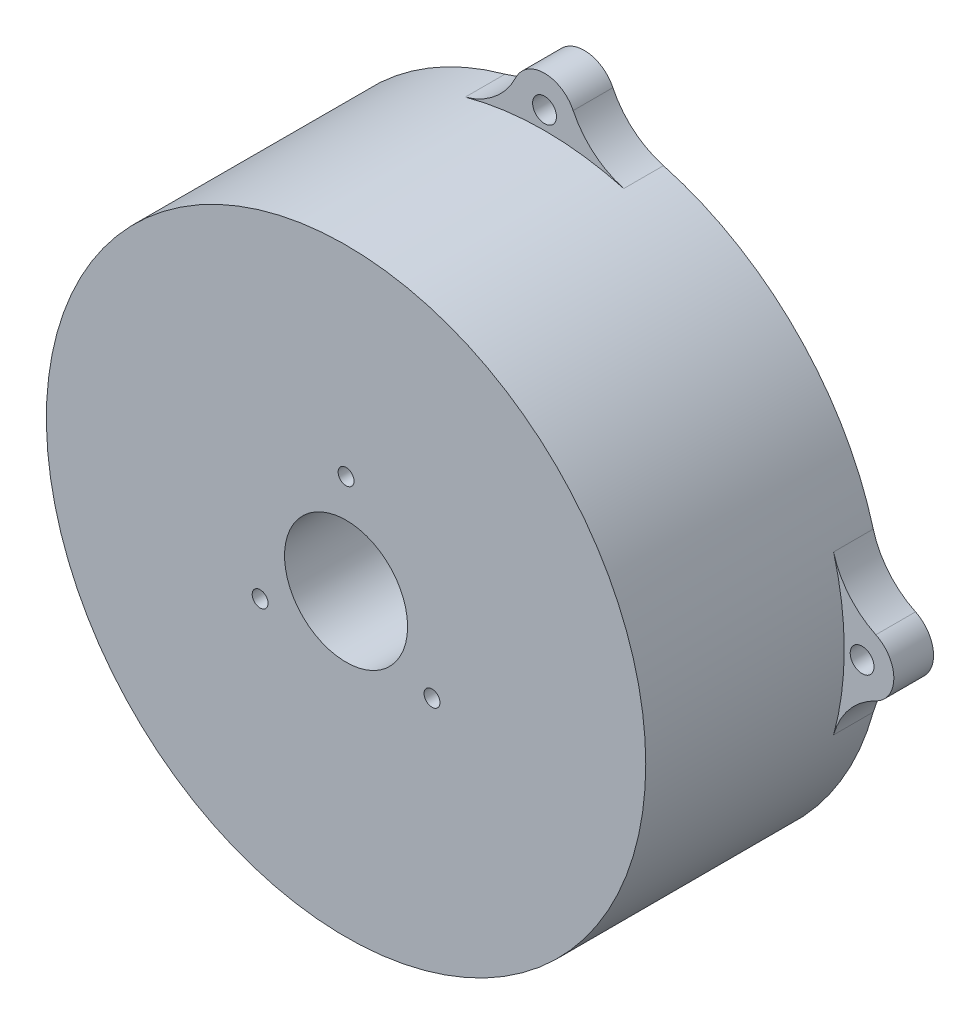
ISO-10303-21;
HEADER;
FILE_DESCRIPTION(('STEP AP214'),'2;1');
FILE_NAME('part.step','',(''),(''),'','','');
FILE_SCHEMA(('AUTOMOTIVE_DESIGN { 1 0 10303 214 1 1 1 1 }'));
ENDSEC;
DATA;
#1=APPLICATION_CONTEXT('core data for automotive mechanical design processes');
#2=APPLICATION_PROTOCOL_DEFINITION('international standard','automotive_design',2000,#1);
#3=PRODUCT_CONTEXT('',#1,'mechanical');
#4=PRODUCT('Part','Part','',(#3));
#5=PRODUCT_RELATED_PRODUCT_CATEGORY('part','',(#4));
#6=PRODUCT_DEFINITION_FORMATION('','',#4);
#7=PRODUCT_DEFINITION_CONTEXT('part definition',#1,'design');
#8=PRODUCT_DEFINITION('design','',#6,#7);
#9=PRODUCT_DEFINITION_SHAPE('','',#8);
#10=(LENGTH_UNIT() NAMED_UNIT(*) SI_UNIT(.MILLI.,.METRE.));
#11=(NAMED_UNIT(*) PLANE_ANGLE_UNIT() SI_UNIT($,.RADIAN.));
#12=(NAMED_UNIT(*) SI_UNIT($,.STERADIAN.) SOLID_ANGLE_UNIT());
#13=UNCERTAINTY_MEASURE_WITH_UNIT(LENGTH_MEASURE(1.E-05),#10,'distance_accuracy_value','');
#14=(GEOMETRIC_REPRESENTATION_CONTEXT(3) GLOBAL_UNCERTAINTY_ASSIGNED_CONTEXT((#13)) GLOBAL_UNIT_ASSIGNED_CONTEXT((#10,
#11,#12)) REPRESENTATION_CONTEXT('',''));
#15=CARTESIAN_POINT('',(0.,0.,0.));
#16=DIRECTION('',(0.,0.,1.));
#17=DIRECTION('',(1.,0.,0.));
#18=AXIS2_PLACEMENT_3D('',#15,#16,#17);
#19=CARTESIAN_POINT('',(0.,0.,30.));
#20=DIRECTION('',(0.,0.,1.));
#21=DIRECTION('',(1.,0.,0.));
#22=AXIS2_PLACEMENT_3D('',#19,#20,#21);
#23=PLANE('',#22);
#24=CARTESIAN_POINT('',(0.,12.5,30.));
#25=DIRECTION('',(0.,0.,1.));
#26=DIRECTION('',(1.,0.,0.));
#27=AXIS2_PLACEMENT_3D('',#24,#25,#26);
#28=CIRCLE('',#27,1.);
#29=CARTESIAN_POINT('',(1.,12.5,30.));
#30=VERTEX_POINT('',#29);
#31=EDGE_CURVE('E216',#30,#30,#28,.T.);
#32=ORIENTED_EDGE('',*,*,#31,.F.);
#33=EDGE_LOOP('',(#32));
#34=FACE_BOUND('',#33,.T.);
#35=CARTESIAN_POINT('',(10.825317547306,-6.24999999999969,30.));
#36=DIRECTION('',(0.,0.,1.));
#37=DIRECTION('',(1.,0.,0.));
#38=AXIS2_PLACEMENT_3D('',#35,#36,#37);
#39=CIRCLE('',#38,1.00000000000048);
#40=CARTESIAN_POINT('',(11.8253175473065,-6.24999999999969,30.));
#41=VERTEX_POINT('',#40);
#42=EDGE_CURVE('E213',#41,#41,#39,.T.);
#43=ORIENTED_EDGE('',*,*,#42,.F.);
#44=EDGE_LOOP('',(#43));
#45=FACE_BOUND('',#44,.T.);
#46=CARTESIAN_POINT('',(-10.825317547305,-6.25000000000031,30.));
#47=DIRECTION('',(0.,0.,1.));
#48=DIRECTION('',(1.,0.,0.));
#49=AXIS2_PLACEMENT_3D('',#46,#47,#48);
#50=CIRCLE('',#49,1.00000000000071);
#51=CARTESIAN_POINT('',(-9.82531754730424,-6.25000000000031,30.));
#52=VERTEX_POINT('',#51);
#53=EDGE_CURVE('E206',#52,#52,#50,.T.);
#54=ORIENTED_EDGE('',*,*,#53,.F.);
#55=EDGE_LOOP('',(#54));
#56=FACE_BOUND('',#55,.T.);
#57=CARTESIAN_POINT('',(0.,0.,30.));
#58=DIRECTION('',(0.,0.,1.));
#59=DIRECTION('',(1.,0.,0.));
#60=AXIS2_PLACEMENT_3D('',#57,#58,#59);
#61=CIRCLE('',#60,37.75);
#62=CARTESIAN_POINT('',(37.75,0.,30.));
#63=VERTEX_POINT('',#62);
#64=EDGE_CURVE('E182',#63,#63,#61,.T.);
#65=ORIENTED_EDGE('',*,*,#64,.T.);
#66=EDGE_LOOP('',(#65));
#67=FACE_BOUND('',#66,.T.);
#68=CARTESIAN_POINT('',(0.,0.,30.));
#69=DIRECTION('',(0.,0.,1.));
#70=DIRECTION('',(1.,0.,0.));
#71=AXIS2_PLACEMENT_3D('',#68,#69,#70);
#72=CIRCLE('',#71,7.75);
#73=CARTESIAN_POINT('',(7.75,0.,30.));
#74=VERTEX_POINT('',#73);
#75=EDGE_CURVE('E191',#74,#74,#72,.T.);
#76=ORIENTED_EDGE('',*,*,#75,.F.);
#77=EDGE_LOOP('',(#76));
#78=FACE_BOUND('',#77,.T.);
#79=ADVANCED_FACE('F37',(#34,#45,#56,#67,#78),#23,.T.);
#80=CARTESIAN_POINT('',(0.,0.,0.));
#81=DIRECTION('',(0.,0.,1.));
#82=DIRECTION('',(1.,0.,0.));
#83=AXIS2_PLACEMENT_3D('',#80,#81,#82);
#84=PLANE('',#83);
#85=CARTESIAN_POINT('',(0.,0.,0.));
#86=DIRECTION('',(0.,0.,1.));
#87=DIRECTION('',(1.,0.,0.));
#88=AXIS2_PLACEMENT_3D('',#85,#86,#87);
#89=CIRCLE('',#88,37.75);
#90=CARTESIAN_POINT('',(36.4066385798428,9.98094020204009,0.));
#91=VERTEX_POINT('',#90);
#92=CARTESIAN_POINT('',(9.9809402020397,36.4066385798429,0.));
#93=VERTEX_POINT('',#92);
#94=EDGE_CURVE('E185',#91,#93,#89,.T.);
#95=ORIENTED_EDGE('',*,*,#94,.F.);
#96=CARTESIAN_POINT('',(46.0507812499999,12.6248978714547,0.));
#97=DIRECTION('',(0.,0.,1.));
#98=DIRECTION('',(1.,0.,0.));
#99=AXIS2_PLACEMENT_3D('',#96,#97,#98);
#100=CIRCLE('',#99,10.);
#101=CARTESIAN_POINT('',(41.7287946428571,3.60711367755878,0.));
#102=VERTEX_POINT('',#101);
#103=EDGE_CURVE('E45',#91,#102,#100,.T.);
#104=ORIENTED_EDGE('',*,*,#103,.T.);
#105=CARTESIAN_POINT('',(40.,4.19845122399165E-13,0.));
#106=DIRECTION('',(0.,0.,-1.));
#107=DIRECTION('',(0.,-1.,0.));
#108=AXIS2_PLACEMENT_3D('',#105,#106,#107);
#109=CIRCLE('',#108,4.);
#110=CARTESIAN_POINT('',(41.7287946428572,-3.6071136775579,0.));
#111=VERTEX_POINT('',#110);
#112=EDGE_CURVE('E255',#102,#111,#109,.T.);
#113=ORIENTED_EDGE('',*,*,#112,.T.);
#114=CARTESIAN_POINT('',(46.0507812500001,-12.6248978714537,0.));
#115=DIRECTION('',(0.,0.,1.));
#116=DIRECTION('',(1.,0.,0.));
#117=AXIS2_PLACEMENT_3D('',#114,#115,#116);
#118=CIRCLE('',#117,10.);
#119=CARTESIAN_POINT('',(36.406638579843,-9.98094020203932,0.));
#120=VERTEX_POINT('',#119);
#121=EDGE_CURVE('E320',#111,#120,#118,.T.);
#122=ORIENTED_EDGE('',*,*,#121,.T.);
#123=CARTESIAN_POINT('',(9.98094020203971,-36.4066385798429,0.));
#124=VERTEX_POINT('',#123);
#125=EDGE_CURVE('E189',#124,#120,#89,.T.);
#126=ORIENTED_EDGE('',*,*,#125,.F.);
#127=CARTESIAN_POINT('',(12.6248978714542,-46.05078125,0.));
#128=DIRECTION('',(0.,0.,1.));
#129=DIRECTION('',(1.,0.,0.));
#130=AXIS2_PLACEMENT_3D('',#127,#128,#129);
#131=CIRCLE('',#130,10.);
#132=CARTESIAN_POINT('',(3.60711367755834,-41.7287946428571,0.));
#133=VERTEX_POINT('',#132);
#134=EDGE_CURVE('E336',#124,#133,#131,.T.);
#135=ORIENTED_EDGE('',*,*,#134,.T.);
#136=CARTESIAN_POINT('',(0.,-40.,0.));
#137=DIRECTION('',(0.,0.,-1.));
#138=DIRECTION('',(-1.,0.,0.));
#139=AXIS2_PLACEMENT_3D('',#136,#137,#138);
#140=CIRCLE('',#139,4.);
#141=CARTESIAN_POINT('',(-3.60711367755834,-41.7287946428571,0.));
#142=VERTEX_POINT('',#141);
#143=EDGE_CURVE('E243',#133,#142,#140,.T.);
#144=ORIENTED_EDGE('',*,*,#143,.T.);
#145=CARTESIAN_POINT('',(-12.6248978714542,-46.05078125,0.));
#146=DIRECTION('',(0.,0.,1.));
#147=DIRECTION('',(1.,0.,0.));
#148=AXIS2_PLACEMENT_3D('',#145,#146,#147);
#149=CIRCLE('',#148,10.);
#150=CARTESIAN_POINT('',(-9.9809402020397,-36.4066385798429,0.));
#151=VERTEX_POINT('',#150);
#152=EDGE_CURVE('E338',#142,#151,#149,.T.);
#153=ORIENTED_EDGE('',*,*,#152,.T.);
#154=CARTESIAN_POINT('',(-36.4066385798429,-9.98094020203983,0.));
#155=VERTEX_POINT('',#154);
#156=EDGE_CURVE('E183',#155,#151,#89,.T.);
#157=ORIENTED_EDGE('',*,*,#156,.F.);
#158=CARTESIAN_POINT('',(-46.05078125,-12.6248978714544,0.));
#159=DIRECTION('',(0.,0.,1.));
#160=DIRECTION('',(1.,0.,0.));
#161=AXIS2_PLACEMENT_3D('',#158,#159,#160);
#162=CIRCLE('',#161,10.);
#163=CARTESIAN_POINT('',(-41.7287946428571,-3.60711367755849,0.));
#164=VERTEX_POINT('',#163);
#165=EDGE_CURVE('E355',#155,#164,#162,.T.);
#166=ORIENTED_EDGE('',*,*,#165,.T.);
#167=CARTESIAN_POINT('',(-40.,-1.40526615291714E-13,0.));
#168=DIRECTION('',(0.,0.,-1.));
#169=DIRECTION('',(0.,1.,0.));
#170=AXIS2_PLACEMENT_3D('',#167,#168,#169);
#171=CIRCLE('',#170,4.);
#172=CARTESIAN_POINT('',(-41.7287946428572,3.6071136775582,0.));
#173=VERTEX_POINT('',#172);
#174=EDGE_CURVE('E232',#164,#173,#171,.T.);
#175=ORIENTED_EDGE('',*,*,#174,.T.);
#176=CARTESIAN_POINT('',(-46.05078125,12.624897871454,0.));
#177=DIRECTION('',(0.,0.,1.));
#178=DIRECTION('',(1.,0.,0.));
#179=AXIS2_PLACEMENT_3D('',#176,#177,#178);
#180=CIRCLE('',#179,10.);
#181=CARTESIAN_POINT('',(-36.406638579843,9.98094020203958,0.));
#182=VERTEX_POINT('',#181);
#183=EDGE_CURVE('E181',#173,#182,#180,.T.);
#184=ORIENTED_EDGE('',*,*,#183,.T.);
#185=CARTESIAN_POINT('',(-9.98094020203971,36.4066385798429,0.));
#186=VERTEX_POINT('',#185);
#187=EDGE_CURVE('E169',#186,#182,#89,.T.);
#188=ORIENTED_EDGE('',*,*,#187,.F.);
#189=CARTESIAN_POINT('',(-12.6248978714542,46.05078125,0.));
#190=DIRECTION('',(0.,0.,1.));
#191=DIRECTION('',(1.,0.,0.));
#192=AXIS2_PLACEMENT_3D('',#189,#190,#191);
#193=CIRCLE('',#192,10.);
#194=CARTESIAN_POINT('',(-3.60711367755834,41.7287946428571,0.));
#195=VERTEX_POINT('',#194);
#196=EDGE_CURVE('E151',#186,#195,#193,.T.);
#197=ORIENTED_EDGE('',*,*,#196,.T.);
#198=CARTESIAN_POINT('',(0.,40.,0.));
#199=DIRECTION('',(0.,0.,-1.));
#200=DIRECTION('',(1.,0.,0.));
#201=AXIS2_PLACEMENT_3D('',#198,#199,#200);
#202=CIRCLE('',#201,4.);
#203=CARTESIAN_POINT('',(3.60711367755834,41.7287946428571,0.));
#204=VERTEX_POINT('',#203);
#205=EDGE_CURVE('E221',#195,#204,#202,.T.);
#206=ORIENTED_EDGE('',*,*,#205,.T.);
#207=CARTESIAN_POINT('',(12.6248978714542,46.05078125,0.));
#208=DIRECTION('',(0.,0.,1.));
#209=DIRECTION('',(1.,0.,0.));
#210=AXIS2_PLACEMENT_3D('',#207,#208,#209);
#211=CIRCLE('',#210,10.);
#212=EDGE_CURVE('E162',#204,#93,#211,.T.);
#213=ORIENTED_EDGE('',*,*,#212,.T.);
#214=EDGE_LOOP('',(#95,#104,#113,#122,#126,#135,#144,#153,#157,#166,#175,#184,#188,#197,#206,#213));
#215=FACE_BOUND('',#214,.T.);
#216=CARTESIAN_POINT('',(0.,0.,0.));
#217=DIRECTION('',(0.,0.,1.));
#218=DIRECTION('',(1.,0.,0.));
#219=AXIS2_PLACEMENT_3D('',#216,#217,#218);
#220=CIRCLE('',#219,7.75);
#221=CARTESIAN_POINT('',(7.75,0.,0.));
#222=VERTEX_POINT('',#221);
#223=EDGE_CURVE('E195',#222,#222,#220,.T.);
#224=ORIENTED_EDGE('',*,*,#223,.T.);
#225=EDGE_LOOP('',(#224));
#226=FACE_BOUND('',#225,.T.);
#227=CARTESIAN_POINT('',(0.,40.,0.));
#228=DIRECTION('',(0.,0.,-1.));
#229=DIRECTION('',(-1.,0.,0.));
#230=AXIS2_PLACEMENT_3D('',#227,#228,#229);
#231=CIRCLE('',#230,1.5);
#232=CARTESIAN_POINT('',(-1.5,40.,0.));
#233=VERTEX_POINT('',#232);
#234=EDGE_CURVE('E226',#233,#233,#231,.T.);
#235=ORIENTED_EDGE('',*,*,#234,.F.);
#236=EDGE_LOOP('',(#235));
#237=FACE_BOUND('',#236,.T.);
#238=CARTESIAN_POINT('',(-40.,-1.39659253553725E-13,0.));
#239=DIRECTION('',(0.,0.,-1.));
#240=DIRECTION('',(0.,-1.,0.));
#241=AXIS2_PLACEMENT_3D('',#238,#239,#240);
#242=CIRCLE('',#241,1.5);
#243=CARTESIAN_POINT('',(-40.,-1.50000000000014,0.));
#244=VERTEX_POINT('',#243);
#245=EDGE_CURVE('E237',#244,#244,#242,.T.);
#246=ORIENTED_EDGE('',*,*,#245,.F.);
#247=EDGE_LOOP('',(#246));
#248=FACE_BOUND('',#247,.T.);
#249=CARTESIAN_POINT('',(0.,-40.,0.));
#250=DIRECTION('',(0.,0.,-1.));
#251=DIRECTION('',(1.,0.,0.));
#252=AXIS2_PLACEMENT_3D('',#249,#250,#251);
#253=CIRCLE('',#252,1.5);
#254=CARTESIAN_POINT('',(1.5,-40.,0.));
#255=VERTEX_POINT('',#254);
#256=EDGE_CURVE('E249',#255,#255,#253,.T.);
#257=ORIENTED_EDGE('',*,*,#256,.F.);
#258=EDGE_LOOP('',(#257));
#259=FACE_BOUND('',#258,.T.);
#260=CARTESIAN_POINT('',(40.,4.18977760661176E-13,0.));
#261=DIRECTION('',(0.,0.,-1.));
#262=DIRECTION('',(0.,1.,0.));
#263=AXIS2_PLACEMENT_3D('',#260,#261,#262);
#264=CIRCLE('',#263,1.5);
#265=CARTESIAN_POINT('',(40.,1.50000000000042,0.));
#266=VERTEX_POINT('',#265);
#267=EDGE_CURVE('E260',#266,#266,#264,.T.);
#268=ORIENTED_EDGE('',*,*,#267,.F.);
#269=EDGE_LOOP('',(#268));
#270=FACE_BOUND('',#269,.T.);
#271=ADVANCED_FACE('F177',(#215,#226,#237,#248,#259,#270),#84,.F.);
#272=CARTESIAN_POINT('',(0.,0.,30.));
#273=DIRECTION('',(0.,0.,-1.));
#274=DIRECTION('',(-1.,0.,0.));
#275=AXIS2_PLACEMENT_3D('',#272,#273,#274);
#276=CYLINDRICAL_SURFACE('',#275,37.75);
#277=ORIENTED_EDGE('',*,*,#64,.F.);
#278=EDGE_LOOP('',(#277));
#279=FACE_BOUND('',#278,.T.);
#280=ORIENTED_EDGE('',*,*,#125,.T.);
#281=DIRECTION('',(0.,0.,-1.));
#282=VECTOR('',#281,1.);
#283=CARTESIAN_POINT('',(36.406638579843,-9.98094020203932,30.));
#284=LINE('',#283,#282);
#285=CARTESIAN_POINT('',(36.406638579843,-9.98094020203932,5.));
#286=VERTEX_POINT('',#285);
#287=EDGE_CURVE('E323',#120,#286,#284,.F.);
#288=ORIENTED_EDGE('',*,*,#287,.T.);
#289=CARTESIAN_POINT('',(0.,0.,5.));
#290=DIRECTION('',(0.,0.,1.));
#291=DIRECTION('',(1.,0.,0.));
#292=AXIS2_PLACEMENT_3D('',#289,#290,#291);
#293=CIRCLE('',#292,37.75);
#294=CARTESIAN_POINT('',(36.4066385798428,9.98094020204009,5.));
#295=VERTEX_POINT('',#294);
#296=EDGE_CURVE('E369',#286,#295,#293,.T.);
#297=ORIENTED_EDGE('',*,*,#296,.T.);
#298=DIRECTION('',(0.,0.,-1.));
#299=VECTOR('',#298,1.);
#300=CARTESIAN_POINT('',(36.4066385798428,9.98094020204009,30.));
#301=LINE('',#300,#299);
#302=EDGE_CURVE('E331',#295,#91,#301,.T.);
#303=ORIENTED_EDGE('',*,*,#302,.T.);
#304=ORIENTED_EDGE('',*,*,#94,.T.);
#305=DIRECTION('',(0.,0.,-1.));
#306=VECTOR('',#305,1.);
#307=CARTESIAN_POINT('',(9.9809402020397,36.4066385798429,30.));
#308=LINE('',#307,#306);
#309=CARTESIAN_POINT('',(9.9809402020397,36.4066385798429,5.));
#310=VERTEX_POINT('',#309);
#311=EDGE_CURVE('E174',#93,#310,#308,.F.);
#312=ORIENTED_EDGE('',*,*,#311,.T.);
#313=CARTESIAN_POINT('',(0.,0.,5.));
#314=DIRECTION('',(0.,0.,1.));
#315=DIRECTION('',(1.,0.,0.));
#316=AXIS2_PLACEMENT_3D('',#313,#314,#315);
#317=CIRCLE('',#316,37.75);
#318=CARTESIAN_POINT('',(-9.98094020203971,36.4066385798429,5.));
#319=VERTEX_POINT('',#318);
#320=EDGE_CURVE('E172',#310,#319,#317,.T.);
#321=ORIENTED_EDGE('',*,*,#320,.T.);
#322=DIRECTION('',(0.,0.,-1.));
#323=VECTOR('',#322,1.);
#324=CARTESIAN_POINT('',(-9.98094020203971,36.4066385798429,30.));
#325=LINE('',#324,#323);
#326=EDGE_CURVE('E155',#319,#186,#325,.T.);
#327=ORIENTED_EDGE('',*,*,#326,.T.);
#328=ORIENTED_EDGE('',*,*,#187,.T.);
#329=DIRECTION('',(0.,0.,-1.));
#330=VECTOR('',#329,1.);
#331=CARTESIAN_POINT('',(-36.406638579843,9.98094020203958,30.));
#332=LINE('',#331,#330);
#333=CARTESIAN_POINT('',(-36.406638579843,9.98094020203958,5.));
#334=VERTEX_POINT('',#333);
#335=EDGE_CURVE('E364',#182,#334,#332,.F.);
#336=ORIENTED_EDGE('',*,*,#335,.T.);
#337=CARTESIAN_POINT('',(0.,0.,5.));
#338=DIRECTION('',(0.,0.,1.));
#339=DIRECTION('',(1.,0.,0.));
#340=AXIS2_PLACEMENT_3D('',#337,#338,#339);
#341=CIRCLE('',#340,37.75);
#342=CARTESIAN_POINT('',(-36.4066385798429,-9.98094020203983,5.));
#343=VERTEX_POINT('',#342);
#344=EDGE_CURVE('E373',#334,#343,#341,.T.);
#345=ORIENTED_EDGE('',*,*,#344,.T.);
#346=DIRECTION('',(0.,0.,-1.));
#347=VECTOR('',#346,1.);
#348=CARTESIAN_POINT('',(-36.4066385798429,-9.98094020203983,30.));
#349=LINE('',#348,#347);
#350=EDGE_CURVE('E366',#343,#155,#349,.T.);
#351=ORIENTED_EDGE('',*,*,#350,.T.);
#352=ORIENTED_EDGE('',*,*,#156,.T.);
#353=DIRECTION('',(0.,0.,-1.));
#354=VECTOR('',#353,1.);
#355=CARTESIAN_POINT('',(-9.9809402020397,-36.4066385798429,30.));
#356=LINE('',#355,#354);
#357=CARTESIAN_POINT('',(-9.9809402020397,-36.4066385798429,5.));
#358=VERTEX_POINT('',#357);
#359=EDGE_CURVE('E346',#151,#358,#356,.F.);
#360=ORIENTED_EDGE('',*,*,#359,.T.);
#361=CARTESIAN_POINT('',(0.,0.,5.));
#362=DIRECTION('',(0.,0.,1.));
#363=DIRECTION('',(1.,0.,0.));
#364=AXIS2_PLACEMENT_3D('',#361,#362,#363);
#365=CIRCLE('',#364,37.75);
#366=CARTESIAN_POINT('',(9.98094020203971,-36.4066385798429,5.));
#367=VERTEX_POINT('',#366);
#368=EDGE_CURVE('E371',#358,#367,#365,.T.);
#369=ORIENTED_EDGE('',*,*,#368,.T.);
#370=DIRECTION('',(0.,0.,-1.));
#371=VECTOR('',#370,1.);
#372=CARTESIAN_POINT('',(9.98094020203971,-36.4066385798429,30.));
#373=LINE('',#372,#371);
#374=EDGE_CURVE('E349',#367,#124,#373,.T.);
#375=ORIENTED_EDGE('',*,*,#374,.T.);
#376=EDGE_LOOP('',(#280,#288,#297,#303,#304,#312,#321,#327,#328,#336,#345,#351,#352,#360,#369,#375));
#377=FACE_BOUND('',#376,.T.);
#378=ADVANCED_FACE('F167',(#279,#377),#276,.T.);
#379=CARTESIAN_POINT('',(0.,0.,30.));
#380=DIRECTION('',(0.,0.,-1.));
#381=DIRECTION('',(-1.,0.,0.));
#382=AXIS2_PLACEMENT_3D('',#379,#380,#381);
#383=CYLINDRICAL_SURFACE('',#382,7.75);
#384=ORIENTED_EDGE('',*,*,#75,.T.);
#385=EDGE_LOOP('',(#384));
#386=FACE_BOUND('',#385,.T.);
#387=ORIENTED_EDGE('',*,*,#223,.F.);
#388=EDGE_LOOP('',(#387));
#389=FACE_BOUND('',#388,.T.);
#390=ADVANCED_FACE('F281',(#386,#389),#383,.F.);
#391=CARTESIAN_POINT('',(-10.825317547305,-6.25000000000031,20.));
#392=DIRECTION('',(0.,0.,1.));
#393=DIRECTION('',(1.,0.,0.));
#394=AXIS2_PLACEMENT_3D('',#391,#392,#393);
#395=CYLINDRICAL_SURFACE('',#394,1.00000000000071);
#396=CARTESIAN_POINT('',(-10.825317547305,-6.25000000000031,20.));
#397=DIRECTION('',(0.,0.,1.));
#398=DIRECTION('',(1.,0.,0.));
#399=AXIS2_PLACEMENT_3D('',#396,#397,#398);
#400=CIRCLE('',#399,1.00000000000071);
#401=CARTESIAN_POINT('',(-9.82531754730424,-6.25000000000031,20.));
#402=VERTEX_POINT('',#401);
#403=EDGE_CURVE('E203',#402,#402,#400,.T.);
#404=ORIENTED_EDGE('',*,*,#403,.F.);
#405=EDGE_LOOP('',(#404));
#406=FACE_BOUND('',#405,.T.);
#407=ORIENTED_EDGE('',*,*,#53,.T.);
#408=EDGE_LOOP('',(#407));
#409=FACE_BOUND('',#408,.T.);
#410=ADVANCED_FACE('F475',(#406,#409),#395,.F.);
#411=CARTESIAN_POINT('',(-10.825317547305,-6.25000000000031,20.));
#412=DIRECTION('',(0.,0.,1.));
#413=DIRECTION('',(1.,0.,0.));
#414=AXIS2_PLACEMENT_3D('',#411,#412,#413);
#415=PLANE('',#414);
#416=ORIENTED_EDGE('',*,*,#403,.T.);
#417=EDGE_LOOP('',(#416));
#418=FACE_BOUND('',#417,.T.);
#419=ADVANCED_FACE('F470',(#418),#415,.T.);
#420=CARTESIAN_POINT('',(10.825317547306,-6.24999999999969,20.));
#421=DIRECTION('',(0.,0.,1.));
#422=DIRECTION('',(1.,0.,0.));
#423=AXIS2_PLACEMENT_3D('',#420,#421,#422);
#424=CYLINDRICAL_SURFACE('',#423,1.00000000000048);
#425=CARTESIAN_POINT('',(10.825317547306,-6.24999999999969,20.));
#426=DIRECTION('',(0.,0.,1.));
#427=DIRECTION('',(1.,0.,0.));
#428=AXIS2_PLACEMENT_3D('',#425,#426,#427);
#429=CIRCLE('',#428,1.00000000000048);
#430=CARTESIAN_POINT('',(11.8253175473065,-6.24999999999969,20.));
#431=VERTEX_POINT('',#430);
#432=EDGE_CURVE('E210',#431,#431,#429,.T.);
#433=ORIENTED_EDGE('',*,*,#432,.F.);
#434=EDGE_LOOP('',(#433));
#435=FACE_BOUND('',#434,.T.);
#436=ORIENTED_EDGE('',*,*,#42,.T.);
#437=EDGE_LOOP('',(#436));
#438=FACE_BOUND('',#437,.T.);
#439=ADVANCED_FACE('F467',(#435,#438),#424,.F.);
#440=CARTESIAN_POINT('',(10.825317547306,-6.24999999999969,20.));
#441=DIRECTION('',(0.,0.,1.));
#442=DIRECTION('',(1.,0.,0.));
#443=AXIS2_PLACEMENT_3D('',#440,#441,#442);
#444=PLANE('',#443);
#445=ORIENTED_EDGE('',*,*,#432,.T.);
#446=EDGE_LOOP('',(#445));
#447=FACE_BOUND('',#446,.T.);
#448=ADVANCED_FACE('F465',(#447),#444,.T.);
#449=CARTESIAN_POINT('',(0.,12.5,20.));
#450=DIRECTION('',(0.,0.,1.));
#451=DIRECTION('',(1.,0.,0.));
#452=AXIS2_PLACEMENT_3D('',#449,#450,#451);
#453=CYLINDRICAL_SURFACE('',#452,1.);
#454=CARTESIAN_POINT('',(0.,12.5,20.));
#455=DIRECTION('',(0.,0.,1.));
#456=DIRECTION('',(1.,0.,0.));
#457=AXIS2_PLACEMENT_3D('',#454,#455,#456);
#458=CIRCLE('',#457,1.);
#459=CARTESIAN_POINT('',(1.,12.5,20.));
#460=VERTEX_POINT('',#459);
#461=EDGE_CURVE('E200',#460,#460,#458,.T.);
#462=ORIENTED_EDGE('',*,*,#461,.F.);
#463=EDGE_LOOP('',(#462));
#464=FACE_BOUND('',#463,.T.);
#465=ORIENTED_EDGE('',*,*,#31,.T.);
#466=EDGE_LOOP('',(#465));
#467=FACE_BOUND('',#466,.T.);
#468=ADVANCED_FACE('F461',(#464,#467),#453,.F.);
#469=CARTESIAN_POINT('',(0.,12.5,20.));
#470=DIRECTION('',(0.,0.,1.));
#471=DIRECTION('',(1.,0.,0.));
#472=AXIS2_PLACEMENT_3D('',#469,#470,#471);
#473=PLANE('',#472);
#474=ORIENTED_EDGE('',*,*,#461,.T.);
#475=EDGE_LOOP('',(#474));
#476=FACE_BOUND('',#475,.T.);
#477=ADVANCED_FACE('F458',(#476),#473,.T.);
#478=CARTESIAN_POINT('',(0.,40.,5.));
#479=DIRECTION('',(0.,0.,-1.));
#480=DIRECTION('',(-1.,0.,0.));
#481=AXIS2_PLACEMENT_3D('',#478,#479,#480);
#482=CYLINDRICAL_SURFACE('',#481,4.);
#483=CARTESIAN_POINT('',(0.,40.,5.));
#484=DIRECTION('',(0.,0.,-1.));
#485=DIRECTION('',(1.,0.,0.));
#486=AXIS2_PLACEMENT_3D('',#483,#484,#485);
#487=CIRCLE('',#486,4.);
#488=CARTESIAN_POINT('',(-3.60711367755834,41.7287946428571,5.));
#489=VERTEX_POINT('',#488);
#490=CARTESIAN_POINT('',(3.60711367755834,41.7287946428571,5.));
#491=VERTEX_POINT('',#490);
#492=EDGE_CURVE('E207',#489,#491,#487,.T.);
#493=ORIENTED_EDGE('',*,*,#492,.T.);
#494=DIRECTION('',(0.,0.,-1.));
#495=VECTOR('',#494,1.);
#496=CARTESIAN_POINT('',(3.60711367755834,41.7287946428571,5.));
#497=LINE('',#496,#495);
#498=EDGE_CURVE('E379',#491,#204,#497,.T.);
#499=ORIENTED_EDGE('',*,*,#498,.T.);
#500=ORIENTED_EDGE('',*,*,#205,.F.);
#501=DIRECTION('',(0.,0.,-1.));
#502=VECTOR('',#501,1.);
#503=CARTESIAN_POINT('',(-3.60711367755834,41.7287946428571,5.));
#504=LINE('',#503,#502);
#505=EDGE_CURVE('E156',#195,#489,#504,.F.);
#506=ORIENTED_EDGE('',*,*,#505,.T.);
#507=EDGE_LOOP('',(#493,#499,#500,#506));
#508=FACE_BOUND('',#507,.T.);
#509=ADVANCED_FACE('F391',(#508),#482,.T.);
#510=CARTESIAN_POINT('',(0.,40.,5.));
#511=DIRECTION('',(0.,0.,1.));
#512=DIRECTION('',(1.,0.,0.));
#513=AXIS2_PLACEMENT_3D('',#510,#511,#512);
#514=PLANE('',#513);
#515=ORIENTED_EDGE('',*,*,#320,.F.);
#516=CARTESIAN_POINT('',(12.6248978714542,46.05078125,5.));
#517=DIRECTION('',(0.,0.,1.));
#518=DIRECTION('',(1.,0.,0.));
#519=AXIS2_PLACEMENT_3D('',#516,#517,#518);
#520=CIRCLE('',#519,10.);
#521=EDGE_CURVE('E377',#310,#491,#520,.F.);
#522=ORIENTED_EDGE('',*,*,#521,.T.);
#523=ORIENTED_EDGE('',*,*,#492,.F.);
#524=CARTESIAN_POINT('',(-12.6248978714542,46.05078125,5.));
#525=DIRECTION('',(0.,0.,1.));
#526=DIRECTION('',(1.,0.,0.));
#527=AXIS2_PLACEMENT_3D('',#524,#525,#526);
#528=CIRCLE('',#527,10.);
#529=EDGE_CURVE('E161',#489,#319,#528,.F.);
#530=ORIENTED_EDGE('',*,*,#529,.T.);
#531=EDGE_LOOP('',(#515,#522,#523,#530));
#532=FACE_BOUND('',#531,.T.);
#533=CARTESIAN_POINT('',(0.,40.,5.));
#534=DIRECTION('',(0.,0.,-1.));
#535=DIRECTION('',(-1.,0.,0.));
#536=AXIS2_PLACEMENT_3D('',#533,#534,#535);
#537=CIRCLE('',#536,1.5);
#538=CARTESIAN_POINT('',(-1.5,40.,5.));
#539=VERTEX_POINT('',#538);
#540=EDGE_CURVE('E223',#539,#539,#537,.T.);
#541=ORIENTED_EDGE('',*,*,#540,.T.);
#542=EDGE_LOOP('',(#541));
#543=FACE_BOUND('',#542,.T.);
#544=ADVANCED_FACE('F388',(#532,#543),#514,.T.);
#545=CARTESIAN_POINT('',(0.,40.,5.));
#546=DIRECTION('',(0.,0.,-1.));
#547=DIRECTION('',(-1.,0.,0.));
#548=AXIS2_PLACEMENT_3D('',#545,#546,#547);
#549=CYLINDRICAL_SURFACE('',#548,1.5);
#550=ORIENTED_EDGE('',*,*,#540,.F.);
#551=EDGE_LOOP('',(#550));
#552=FACE_BOUND('',#551,.T.);
#553=ORIENTED_EDGE('',*,*,#234,.T.);
#554=EDGE_LOOP('',(#553));
#555=FACE_BOUND('',#554,.T.);
#556=ADVANCED_FACE('F291',(#552,#555),#549,.F.);
#557=CARTESIAN_POINT('',(12.6248978714542,46.05078125,5.));
#558=DIRECTION('',(0.,0.,-1.));
#559=DIRECTION('',(-1.,0.,0.));
#560=AXIS2_PLACEMENT_3D('',#557,#558,#559);
#561=CYLINDRICAL_SURFACE('',#560,10.);
#562=ORIENTED_EDGE('',*,*,#212,.F.);
#563=ORIENTED_EDGE('',*,*,#498,.F.);
#564=ORIENTED_EDGE('',*,*,#521,.F.);
#565=ORIENTED_EDGE('',*,*,#311,.F.);
#566=EDGE_LOOP('',(#562,#563,#564,#565));
#567=FACE_BOUND('',#566,.T.);
#568=ADVANCED_FACE('F288',(#567),#561,.F.);
#569=CARTESIAN_POINT('',(-12.6248978714542,46.05078125,5.));
#570=DIRECTION('',(0.,0.,1.));
#571=DIRECTION('',(1.,0.,0.));
#572=AXIS2_PLACEMENT_3D('',#569,#570,#571);
#573=CYLINDRICAL_SURFACE('',#572,10.);
#574=ORIENTED_EDGE('',*,*,#529,.F.);
#575=ORIENTED_EDGE('',*,*,#505,.F.);
#576=ORIENTED_EDGE('',*,*,#196,.F.);
#577=ORIENTED_EDGE('',*,*,#326,.F.);
#578=EDGE_LOOP('',(#574,#575,#576,#577));
#579=FACE_BOUND('',#578,.T.);
#580=ADVANCED_FACE('F154',(#579),#573,.F.);
#581=CARTESIAN_POINT('',(-40.,-1.40526615291714E-13,5.));
#582=DIRECTION('',(0.,0.,-1.));
#583=DIRECTION('',(-1.,0.,0.));
#584=AXIS2_PLACEMENT_3D('',#581,#582,#583);
#585=CYLINDRICAL_SURFACE('',#584,4.);
#586=CARTESIAN_POINT('',(-40.,-1.40526615291714E-13,5.));
#587=DIRECTION('',(0.,0.,-1.));
#588=DIRECTION('',(0.,1.,0.));
#589=AXIS2_PLACEMENT_3D('',#586,#587,#588);
#590=CIRCLE('',#589,4.);
#591=CARTESIAN_POINT('',(-41.7287946428571,-3.60711367755849,5.));
#592=VERTEX_POINT('',#591);
#593=CARTESIAN_POINT('',(-41.7287946428572,3.6071136775582,5.));
#594=VERTEX_POINT('',#593);
#595=EDGE_CURVE('E229',#592,#594,#590,.T.);
#596=ORIENTED_EDGE('',*,*,#595,.T.);
#597=DIRECTION('',(0.,0.,-1.));
#598=VECTOR('',#597,1.);
#599=CARTESIAN_POINT('',(-41.7287946428572,3.6071136775582,5.));
#600=LINE('',#599,#598);
#601=EDGE_CURVE('E360',#594,#173,#600,.T.);
#602=ORIENTED_EDGE('',*,*,#601,.T.);
#603=ORIENTED_EDGE('',*,*,#174,.F.);
#604=DIRECTION('',(0.,0.,-1.));
#605=VECTOR('',#604,1.);
#606=CARTESIAN_POINT('',(-41.7287946428571,-3.60711367755849,5.));
#607=LINE('',#606,#605);
#608=EDGE_CURVE('E362',#164,#592,#607,.F.);
#609=ORIENTED_EDGE('',*,*,#608,.T.);
#610=EDGE_LOOP('',(#596,#602,#603,#609));
#611=FACE_BOUND('',#610,.T.);
#612=ADVANCED_FACE('F295',(#611),#585,.T.);
#613=CARTESIAN_POINT('',(-40.,-1.40526615291714E-13,5.));
#614=DIRECTION('',(0.,0.,1.));
#615=DIRECTION('',(0.,1.,0.));
#616=AXIS2_PLACEMENT_3D('',#613,#614,#615);
#617=PLANE('',#616);
#618=ORIENTED_EDGE('',*,*,#344,.F.);
#619=CARTESIAN_POINT('',(-46.05078125,12.624897871454,5.));
#620=DIRECTION('',(0.,0.,1.));
#621=DIRECTION('',(1.,0.,0.));
#622=AXIS2_PLACEMENT_3D('',#619,#620,#621);
#623=CIRCLE('',#622,10.);
#624=EDGE_CURVE('E358',#334,#594,#623,.F.);
#625=ORIENTED_EDGE('',*,*,#624,.T.);
#626=ORIENTED_EDGE('',*,*,#595,.F.);
#627=CARTESIAN_POINT('',(-46.05078125,-12.6248978714544,5.));
#628=DIRECTION('',(0.,0.,1.));
#629=DIRECTION('',(1.,0.,0.));
#630=AXIS2_PLACEMENT_3D('',#627,#628,#629);
#631=CIRCLE('',#630,10.);
#632=EDGE_CURVE('E352',#592,#343,#631,.F.);
#633=ORIENTED_EDGE('',*,*,#632,.T.);
#634=EDGE_LOOP('',(#618,#625,#626,#633));
#635=FACE_BOUND('',#634,.T.);
#636=CARTESIAN_POINT('',(-40.,-1.39659253553725E-13,5.));
#637=DIRECTION('',(0.,0.,-1.));
#638=DIRECTION('',(0.,-1.,0.));
#639=AXIS2_PLACEMENT_3D('',#636,#637,#638);
#640=CIRCLE('',#639,1.5);
#641=CARTESIAN_POINT('',(-40.,-1.50000000000014,5.));
#642=VERTEX_POINT('',#641);
#643=EDGE_CURVE('E234',#642,#642,#640,.T.);
#644=ORIENTED_EDGE('',*,*,#643,.T.);
#645=EDGE_LOOP('',(#644));
#646=FACE_BOUND('',#645,.T.);
#647=ADVANCED_FACE('F419',(#635,#646),#617,.T.);
#648=CARTESIAN_POINT('',(-40.,-1.39659253553725E-13,5.));
#649=DIRECTION('',(0.,0.,-1.));
#650=DIRECTION('',(-1.,0.,0.));
#651=AXIS2_PLACEMENT_3D('',#648,#649,#650);
#652=CYLINDRICAL_SURFACE('',#651,1.5);
#653=ORIENTED_EDGE('',*,*,#643,.F.);
#654=EDGE_LOOP('',(#653));
#655=FACE_BOUND('',#654,.T.);
#656=ORIENTED_EDGE('',*,*,#245,.T.);
#657=EDGE_LOOP('',(#656));
#658=FACE_BOUND('',#657,.T.);
#659=ADVANCED_FACE('F422',(#655,#658),#652,.F.);
#660=CARTESIAN_POINT('',(0.,-40.,5.));
#661=DIRECTION('',(0.,0.,-1.));
#662=DIRECTION('',(-1.,0.,0.));
#663=AXIS2_PLACEMENT_3D('',#660,#661,#662);
#664=CYLINDRICAL_SURFACE('',#663,4.);
#665=CARTESIAN_POINT('',(0.,-40.,5.));
#666=DIRECTION('',(0.,0.,-1.));
#667=DIRECTION('',(-1.,0.,0.));
#668=AXIS2_PLACEMENT_3D('',#665,#666,#667);
#669=CIRCLE('',#668,4.);
#670=CARTESIAN_POINT('',(3.60711367755834,-41.7287946428571,5.));
#671=VERTEX_POINT('',#670);
#672=CARTESIAN_POINT('',(-3.60711367755834,-41.7287946428571,5.));
#673=VERTEX_POINT('',#672);
#674=EDGE_CURVE('E240',#671,#673,#669,.T.);
#675=ORIENTED_EDGE('',*,*,#674,.T.);
#676=DIRECTION('',(0.,0.,-1.));
#677=VECTOR('',#676,1.);
#678=CARTESIAN_POINT('',(-3.60711367755834,-41.7287946428571,5.));
#679=LINE('',#678,#677);
#680=EDGE_CURVE('E342',#673,#142,#679,.T.);
#681=ORIENTED_EDGE('',*,*,#680,.T.);
#682=ORIENTED_EDGE('',*,*,#143,.F.);
#683=DIRECTION('',(0.,0.,-1.));
#684=VECTOR('',#683,1.);
#685=CARTESIAN_POINT('',(3.60711367755834,-41.7287946428571,5.));
#686=LINE('',#685,#684);
#687=EDGE_CURVE('E344',#133,#671,#686,.F.);
#688=ORIENTED_EDGE('',*,*,#687,.T.);
#689=EDGE_LOOP('',(#675,#681,#682,#688));
#690=FACE_BOUND('',#689,.T.);
#691=ADVANCED_FACE('F400',(#690),#664,.T.);
#692=CARTESIAN_POINT('',(0.,-40.,5.));
#693=DIRECTION('',(0.,0.,1.));
#694=DIRECTION('',(-1.,0.,0.));
#695=AXIS2_PLACEMENT_3D('',#692,#693,#694);
#696=PLANE('',#695);
#697=ORIENTED_EDGE('',*,*,#368,.F.);
#698=CARTESIAN_POINT('',(-12.6248978714542,-46.05078125,5.));
#699=DIRECTION('',(0.,0.,1.));
#700=DIRECTION('',(1.,0.,0.));
#701=AXIS2_PLACEMENT_3D('',#698,#699,#700);
#702=CIRCLE('',#701,10.);
#703=EDGE_CURVE('E340',#358,#673,#702,.F.);
#704=ORIENTED_EDGE('',*,*,#703,.T.);
#705=ORIENTED_EDGE('',*,*,#674,.F.);
#706=CARTESIAN_POINT('',(12.6248978714542,-46.05078125,5.));
#707=DIRECTION('',(0.,0.,1.));
#708=DIRECTION('',(1.,0.,0.));
#709=AXIS2_PLACEMENT_3D('',#706,#707,#708);
#710=CIRCLE('',#709,10.);
#711=EDGE_CURVE('E333',#671,#367,#710,.F.);
#712=ORIENTED_EDGE('',*,*,#711,.T.);
#713=EDGE_LOOP('',(#697,#704,#705,#712));
#714=FACE_BOUND('',#713,.T.);
#715=CARTESIAN_POINT('',(0.,-40.,5.));
#716=DIRECTION('',(0.,0.,-1.));
#717=DIRECTION('',(1.,0.,0.));
#718=AXIS2_PLACEMENT_3D('',#715,#716,#717);
#719=CIRCLE('',#718,1.5);
#720=CARTESIAN_POINT('',(1.5,-40.,5.));
#721=VERTEX_POINT('',#720);
#722=EDGE_CURVE('E246',#721,#721,#719,.T.);
#723=ORIENTED_EDGE('',*,*,#722,.T.);
#724=EDGE_LOOP('',(#723));
#725=FACE_BOUND('',#724,.T.);
#726=ADVANCED_FACE('F405',(#714,#725),#696,.T.);
#727=CARTESIAN_POINT('',(0.,-40.,5.));
#728=DIRECTION('',(0.,0.,-1.));
#729=DIRECTION('',(-1.,0.,0.));
#730=AXIS2_PLACEMENT_3D('',#727,#728,#729);
#731=CYLINDRICAL_SURFACE('',#730,1.5);
#732=ORIENTED_EDGE('',*,*,#722,.F.);
#733=EDGE_LOOP('',(#732));
#734=FACE_BOUND('',#733,.T.);
#735=ORIENTED_EDGE('',*,*,#256,.T.);
#736=EDGE_LOOP('',(#735));
#737=FACE_BOUND('',#736,.T.);
#738=ADVANCED_FACE('F434',(#734,#737),#731,.F.);
#739=CARTESIAN_POINT('',(40.,4.19845122399165E-13,5.));
#740=DIRECTION('',(0.,0.,-1.));
#741=DIRECTION('',(-1.,0.,0.));
#742=AXIS2_PLACEMENT_3D('',#739,#740,#741);
#743=CYLINDRICAL_SURFACE('',#742,4.);
#744=CARTESIAN_POINT('',(40.,4.19845122399165E-13,5.));
#745=DIRECTION('',(0.,0.,-1.));
#746=DIRECTION('',(0.,-1.,0.));
#747=AXIS2_PLACEMENT_3D('',#744,#745,#746);
#748=CIRCLE('',#747,4.);
#749=CARTESIAN_POINT('',(41.7287946428571,3.60711367755878,5.));
#750=VERTEX_POINT('',#749);
#751=CARTESIAN_POINT('',(41.7287946428572,-3.6071136775579,5.));
#752=VERTEX_POINT('',#751);
#753=EDGE_CURVE('E252',#750,#752,#748,.T.);
#754=ORIENTED_EDGE('',*,*,#753,.T.);
#755=DIRECTION('',(0.,0.,-1.));
#756=VECTOR('',#755,1.);
#757=CARTESIAN_POINT('',(41.7287946428572,-3.6071136775579,5.));
#758=LINE('',#757,#756);
#759=EDGE_CURVE('E321',#752,#111,#758,.T.);
#760=ORIENTED_EDGE('',*,*,#759,.T.);
#761=ORIENTED_EDGE('',*,*,#112,.F.);
#762=DIRECTION('',(0.,0.,-1.));
#763=VECTOR('',#762,1.);
#764=CARTESIAN_POINT('',(41.7287946428571,3.60711367755878,5.));
#765=LINE('',#764,#763);
#766=EDGE_CURVE('E59',#102,#750,#765,.F.);
#767=ORIENTED_EDGE('',*,*,#766,.T.);
#768=EDGE_LOOP('',(#754,#760,#761,#767));
#769=FACE_BOUND('',#768,.T.);
#770=ADVANCED_FACE('F393',(#769),#743,.T.);
#771=CARTESIAN_POINT('',(40.,4.19845122399165E-13,5.));
#772=DIRECTION('',(0.,0.,1.));
#773=DIRECTION('',(0.,-1.,0.));
#774=AXIS2_PLACEMENT_3D('',#771,#772,#773);
#775=PLANE('',#774);
#776=ORIENTED_EDGE('',*,*,#753,.F.);
#777=CARTESIAN_POINT('',(46.0507812499999,12.6248978714547,5.));
#778=DIRECTION('',(0.,0.,1.));
#779=DIRECTION('',(1.,0.,0.));
#780=AXIS2_PLACEMENT_3D('',#777,#778,#779);
#781=CIRCLE('',#780,10.);
#782=EDGE_CURVE('E11',#750,#295,#781,.F.);
#783=ORIENTED_EDGE('',*,*,#782,.T.);
#784=ORIENTED_EDGE('',*,*,#296,.F.);
#785=CARTESIAN_POINT('',(46.0507812500001,-12.6248978714537,5.));
#786=DIRECTION('',(0.,0.,1.));
#787=DIRECTION('',(1.,0.,0.));
#788=AXIS2_PLACEMENT_3D('',#785,#786,#787);
#789=CIRCLE('',#788,10.);
#790=EDGE_CURVE('E52',#286,#752,#789,.F.);
#791=ORIENTED_EDGE('',*,*,#790,.T.);
#792=EDGE_LOOP('',(#776,#783,#784,#791));
#793=FACE_BOUND('',#792,.T.);
#794=CARTESIAN_POINT('',(40.,4.18977760661176E-13,5.));
#795=DIRECTION('',(0.,0.,-1.));
#796=DIRECTION('',(0.,1.,0.));
#797=AXIS2_PLACEMENT_3D('',#794,#795,#796);
#798=CIRCLE('',#797,1.5);
#799=CARTESIAN_POINT('',(40.,1.50000000000042,5.));
#800=VERTEX_POINT('',#799);
#801=EDGE_CURVE('E258',#800,#800,#798,.T.);
#802=ORIENTED_EDGE('',*,*,#801,.T.);
#803=EDGE_LOOP('',(#802));
#804=FACE_BOUND('',#803,.T.);
#805=ADVANCED_FACE('F266',(#793,#804),#775,.T.);
#806=CARTESIAN_POINT('',(40.,4.18977760661176E-13,5.));
#807=DIRECTION('',(0.,0.,-1.));
#808=DIRECTION('',(-1.,0.,0.));
#809=AXIS2_PLACEMENT_3D('',#806,#807,#808);
#810=CYLINDRICAL_SURFACE('',#809,1.5);
#811=ORIENTED_EDGE('',*,*,#801,.F.);
#812=EDGE_LOOP('',(#811));
#813=FACE_BOUND('',#812,.T.);
#814=ORIENTED_EDGE('',*,*,#267,.T.);
#815=EDGE_LOOP('',(#814));
#816=FACE_BOUND('',#815,.T.);
#817=ADVANCED_FACE('F268',(#813,#816),#810,.F.);
#818=CARTESIAN_POINT('',(-46.05078125,12.624897871454,5.));
#819=DIRECTION('',(0.,0.,-1.));
#820=DIRECTION('',(-1.,0.,0.));
#821=AXIS2_PLACEMENT_3D('',#818,#819,#820);
#822=CYLINDRICAL_SURFACE('',#821,10.);
#823=ORIENTED_EDGE('',*,*,#183,.F.);
#824=ORIENTED_EDGE('',*,*,#601,.F.);
#825=ORIENTED_EDGE('',*,*,#624,.F.);
#826=ORIENTED_EDGE('',*,*,#335,.F.);
#827=EDGE_LOOP('',(#823,#824,#825,#826));
#828=FACE_BOUND('',#827,.T.);
#829=ADVANCED_FACE('F271',(#828),#822,.F.);
#830=CARTESIAN_POINT('',(-46.05078125,-12.6248978714544,5.));
#831=DIRECTION('',(0.,0.,1.));
#832=DIRECTION('',(1.,0.,0.));
#833=AXIS2_PLACEMENT_3D('',#830,#831,#832);
#834=CYLINDRICAL_SURFACE('',#833,10.);
#835=ORIENTED_EDGE('',*,*,#632,.F.);
#836=ORIENTED_EDGE('',*,*,#608,.F.);
#837=ORIENTED_EDGE('',*,*,#165,.F.);
#838=ORIENTED_EDGE('',*,*,#350,.F.);
#839=EDGE_LOOP('',(#835,#836,#837,#838));
#840=FACE_BOUND('',#839,.T.);
#841=ADVANCED_FACE('F298',(#840),#834,.F.);
#842=CARTESIAN_POINT('',(-12.6248978714542,-46.05078125,5.));
#843=DIRECTION('',(0.,0.,-1.));
#844=DIRECTION('',(-1.,0.,0.));
#845=AXIS2_PLACEMENT_3D('',#842,#843,#844);
#846=CYLINDRICAL_SURFACE('',#845,10.);
#847=ORIENTED_EDGE('',*,*,#152,.F.);
#848=ORIENTED_EDGE('',*,*,#680,.F.);
#849=ORIENTED_EDGE('',*,*,#703,.F.);
#850=ORIENTED_EDGE('',*,*,#359,.F.);
#851=EDGE_LOOP('',(#847,#848,#849,#850));
#852=FACE_BOUND('',#851,.T.);
#853=ADVANCED_FACE('F302',(#852),#846,.F.);
#854=CARTESIAN_POINT('',(12.6248978714542,-46.05078125,5.));
#855=DIRECTION('',(0.,0.,1.));
#856=DIRECTION('',(1.,0.,0.));
#857=AXIS2_PLACEMENT_3D('',#854,#855,#856);
#858=CYLINDRICAL_SURFACE('',#857,10.);
#859=ORIENTED_EDGE('',*,*,#711,.F.);
#860=ORIENTED_EDGE('',*,*,#687,.F.);
#861=ORIENTED_EDGE('',*,*,#134,.F.);
#862=ORIENTED_EDGE('',*,*,#374,.F.);
#863=EDGE_LOOP('',(#859,#860,#861,#862));
#864=FACE_BOUND('',#863,.T.);
#865=ADVANCED_FACE('F306',(#864),#858,.F.);
#866=CARTESIAN_POINT('',(46.0507812500001,-12.6248978714537,5.));
#867=DIRECTION('',(0.,0.,-1.));
#868=DIRECTION('',(-1.,0.,0.));
#869=AXIS2_PLACEMENT_3D('',#866,#867,#868);
#870=CYLINDRICAL_SURFACE('',#869,10.);
#871=ORIENTED_EDGE('',*,*,#121,.F.);
#872=ORIENTED_EDGE('',*,*,#759,.F.);
#873=ORIENTED_EDGE('',*,*,#790,.F.);
#874=ORIENTED_EDGE('',*,*,#287,.F.);
#875=EDGE_LOOP('',(#871,#872,#873,#874));
#876=FACE_BOUND('',#875,.T.);
#877=ADVANCED_FACE('F309',(#876),#870,.F.);
#878=CARTESIAN_POINT('',(46.0507812499999,12.6248978714547,5.));
#879=DIRECTION('',(0.,0.,1.));
#880=DIRECTION('',(1.,0.,0.));
#881=AXIS2_PLACEMENT_3D('',#878,#879,#880);
#882=CYLINDRICAL_SURFACE('',#881,10.);
#883=ORIENTED_EDGE('',*,*,#782,.F.);
#884=ORIENTED_EDGE('',*,*,#766,.F.);
#885=ORIENTED_EDGE('',*,*,#103,.F.);
#886=ORIENTED_EDGE('',*,*,#302,.F.);
#887=EDGE_LOOP('',(#883,#884,#885,#886));
#888=FACE_BOUND('',#887,.T.);
#889=ADVANCED_FACE('F39',(#888),#882,.F.);
#890=CLOSED_SHELL('',(#79,#271,#378,#390,#410,#419,#439,#448,#468,#477,#509,#544,#556,#568,#580,
#612,#647,#659,#691,#726,#738,#770,#805,#817,#829,#841,#853,#865,#877,#889));
#891=MANIFOLD_SOLID_BREP('B2',#890);
#892=ADVANCED_BREP_SHAPE_REPRESENTATION('',(#18,#891),#14);
#893=SHAPE_DEFINITION_REPRESENTATION(#9,#892);
ENDSEC;
END-ISO-10303-21;
